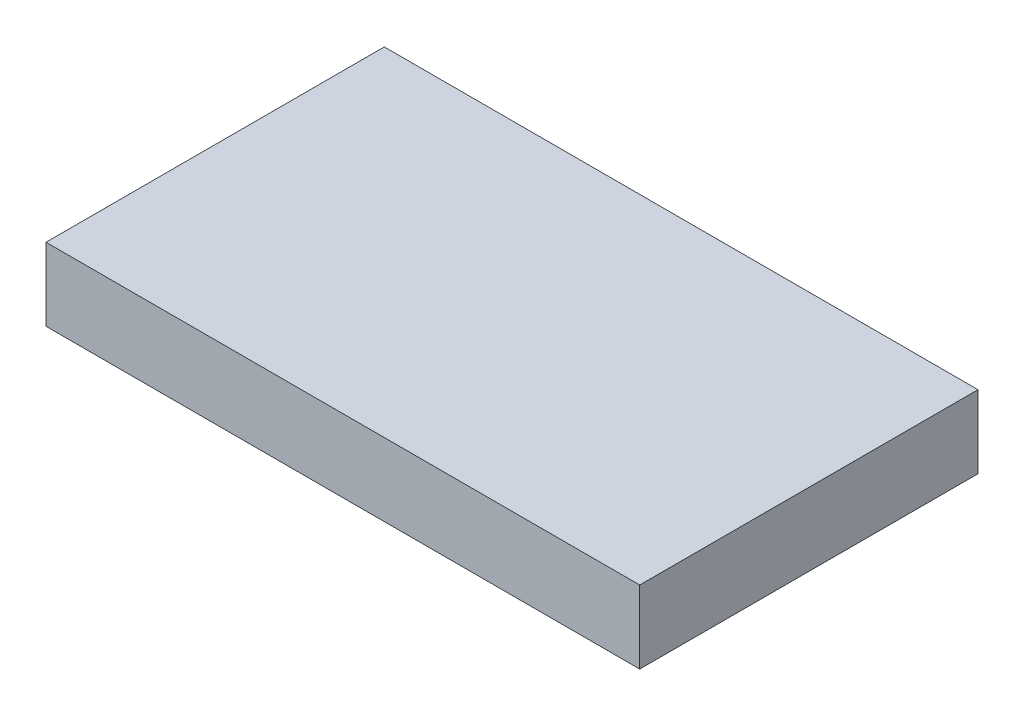
ISO-10303-21;
HEADER;
FILE_DESCRIPTION(('STEP AP214'),'2;1');
FILE_NAME('part.step','',(''),(''),'','','');
FILE_SCHEMA(('AUTOMOTIVE_DESIGN { 1 0 10303 214 1 1 1 1 }'));
ENDSEC;
DATA;
#1=APPLICATION_CONTEXT('core data for automotive mechanical design processes');
#2=APPLICATION_PROTOCOL_DEFINITION('international standard','automotive_design',2000,#1);
#3=PRODUCT_CONTEXT('',#1,'mechanical');
#4=PRODUCT('Part','Part','',(#3));
#5=PRODUCT_RELATED_PRODUCT_CATEGORY('part','',(#4));
#6=PRODUCT_DEFINITION_FORMATION('','',#4);
#7=PRODUCT_DEFINITION_CONTEXT('part definition',#1,'design');
#8=PRODUCT_DEFINITION('design','',#6,#7);
#9=PRODUCT_DEFINITION_SHAPE('','',#8);
#10=(LENGTH_UNIT() NAMED_UNIT(*) SI_UNIT(.MILLI.,.METRE.));
#11=(NAMED_UNIT(*) PLANE_ANGLE_UNIT() SI_UNIT($,.RADIAN.));
#12=(NAMED_UNIT(*) SI_UNIT($,.STERADIAN.) SOLID_ANGLE_UNIT());
#13=UNCERTAINTY_MEASURE_WITH_UNIT(LENGTH_MEASURE(1.E-05),#10,'distance_accuracy_value','');
#14=(GEOMETRIC_REPRESENTATION_CONTEXT(3) GLOBAL_UNCERTAINTY_ASSIGNED_CONTEXT((#13)) GLOBAL_UNIT_ASSIGNED_CONTEXT((#10,
#11,#12)) REPRESENTATION_CONTEXT('',''));
#15=CARTESIAN_POINT('',(0.,0.,0.));
#16=DIRECTION('',(0.,0.,1.));
#17=DIRECTION('',(1.,0.,0.));
#18=AXIS2_PLACEMENT_3D('',#15,#16,#17);
#19=CARTESIAN_POINT('',(26.5,6.5,15.1));
#20=DIRECTION('',(-1.,0.,0.));
#21=DIRECTION('',(0.,0.,1.));
#22=AXIS2_PLACEMENT_3D('',#19,#20,#21);
#23=PLANE('',#22);
#24=DIRECTION('',(0.,0.,-1.));
#25=VECTOR('',#24,1.);
#26=CARTESIAN_POINT('',(26.5,0.,15.1));
#27=LINE('',#26,#25);
#28=CARTESIAN_POINT('',(26.5,0.,15.1));
#29=VERTEX_POINT('',#28);
#30=CARTESIAN_POINT('',(26.5,0.,-15.1));
#31=VERTEX_POINT('',#30);
#32=EDGE_CURVE('E106',#29,#31,#27,.T.);
#33=ORIENTED_EDGE('',*,*,#32,.T.);
#34=DIRECTION('',(0.,-1.,0.));
#35=VECTOR('',#34,1.);
#36=CARTESIAN_POINT('',(26.5,6.5,-15.1));
#37=LINE('',#36,#35);
#38=CARTESIAN_POINT('',(26.5,6.5,-15.1));
#39=VERTEX_POINT('',#38);
#40=EDGE_CURVE('E11',#39,#31,#37,.T.);
#41=ORIENTED_EDGE('',*,*,#40,.F.);
#42=DIRECTION('',(0.,0.,-1.));
#43=VECTOR('',#42,1.);
#44=CARTESIAN_POINT('',(26.5,6.5,15.1));
#45=LINE('',#44,#43);
#46=CARTESIAN_POINT('',(26.5,6.5,15.1));
#47=VERTEX_POINT('',#46);
#48=EDGE_CURVE('E94',#47,#39,#45,.T.);
#49=ORIENTED_EDGE('',*,*,#48,.F.);
#50=DIRECTION('',(0.,-1.,0.));
#51=VECTOR('',#50,1.);
#52=CARTESIAN_POINT('',(26.5,6.5,15.1));
#53=LINE('',#52,#51);
#54=EDGE_CURVE('E102',#47,#29,#53,.T.);
#55=ORIENTED_EDGE('',*,*,#54,.T.);
#56=EDGE_LOOP('',(#33,#41,#49,#55));
#57=FACE_BOUND('',#56,.T.);
#58=ADVANCED_FACE('F43',(#57),#23,.F.);
#59=CARTESIAN_POINT('',(-26.5,6.5,-15.1));
#60=DIRECTION('',(0.,0.,1.));
#61=DIRECTION('',(1.,0.,0.));
#62=AXIS2_PLACEMENT_3D('',#59,#60,#61);
#63=PLANE('',#62);
#64=DIRECTION('',(-1.,0.,0.));
#65=VECTOR('',#64,1.);
#66=CARTESIAN_POINT('',(-26.5,0.,-15.1));
#67=LINE('',#66,#65);
#68=CARTESIAN_POINT('',(-26.5,0.,-15.1));
#69=VERTEX_POINT('',#68);
#70=EDGE_CURVE('E98',#31,#69,#67,.T.);
#71=ORIENTED_EDGE('',*,*,#70,.T.);
#72=DIRECTION('',(0.,-1.,0.));
#73=VECTOR('',#72,1.);
#74=CARTESIAN_POINT('',(-26.5,6.5,-15.1));
#75=LINE('',#74,#73);
#76=CARTESIAN_POINT('',(-26.5,6.5,-15.1));
#77=VERTEX_POINT('',#76);
#78=EDGE_CURVE('E51',#77,#69,#75,.T.);
#79=ORIENTED_EDGE('',*,*,#78,.F.);
#80=DIRECTION('',(-1.,0.,0.));
#81=VECTOR('',#80,1.);
#82=CARTESIAN_POINT('',(-26.5,6.5,-15.1));
#83=LINE('',#82,#81);
#84=EDGE_CURVE('E89',#39,#77,#83,.T.);
#85=ORIENTED_EDGE('',*,*,#84,.F.);
#86=ORIENTED_EDGE('',*,*,#40,.T.);
#87=EDGE_LOOP('',(#71,#79,#85,#86));
#88=FACE_BOUND('',#87,.T.);
#89=ADVANCED_FACE('F97',(#88),#63,.F.);
#90=CARTESIAN_POINT('',(-26.5,6.5,15.1));
#91=DIRECTION('',(1.,0.,0.));
#92=DIRECTION('',(0.,0.,-1.));
#93=AXIS2_PLACEMENT_3D('',#90,#91,#92);
#94=PLANE('',#93);
#95=DIRECTION('',(0.,0.,1.));
#96=VECTOR('',#95,1.);
#97=CARTESIAN_POINT('',(-26.5,0.,15.1));
#98=LINE('',#97,#96);
#99=CARTESIAN_POINT('',(-26.5,0.,15.1));
#100=VERTEX_POINT('',#99);
#101=EDGE_CURVE('E76',#69,#100,#98,.T.);
#102=ORIENTED_EDGE('',*,*,#101,.T.);
#103=DIRECTION('',(0.,-1.,0.));
#104=VECTOR('',#103,1.);
#105=CARTESIAN_POINT('',(-26.5,6.5,15.1));
#106=LINE('',#105,#104);
#107=CARTESIAN_POINT('',(-26.5,6.5,15.1));
#108=VERTEX_POINT('',#107);
#109=EDGE_CURVE('E99',#108,#100,#106,.T.);
#110=ORIENTED_EDGE('',*,*,#109,.F.);
#111=DIRECTION('',(0.,0.,1.));
#112=VECTOR('',#111,1.);
#113=CARTESIAN_POINT('',(-26.5,6.5,15.1));
#114=LINE('',#113,#112);
#115=EDGE_CURVE('E92',#77,#108,#114,.T.);
#116=ORIENTED_EDGE('',*,*,#115,.F.);
#117=ORIENTED_EDGE('',*,*,#78,.T.);
#118=EDGE_LOOP('',(#102,#110,#116,#117));
#119=FACE_BOUND('',#118,.T.);
#120=ADVANCED_FACE('F100',(#119),#94,.F.);
#121=CARTESIAN_POINT('',(-26.5,6.5,15.1));
#122=DIRECTION('',(0.,0.,-1.));
#123=DIRECTION('',(-1.,0.,0.));
#124=AXIS2_PLACEMENT_3D('',#121,#122,#123);
#125=PLANE('',#124);
#126=DIRECTION('',(1.,0.,0.));
#127=VECTOR('',#126,1.);
#128=CARTESIAN_POINT('',(-26.5,0.,15.1));
#129=LINE('',#128,#127);
#130=EDGE_CURVE('E82',#100,#29,#129,.T.);
#131=ORIENTED_EDGE('',*,*,#130,.T.);
#132=ORIENTED_EDGE('',*,*,#54,.F.);
#133=DIRECTION('',(1.,0.,0.));
#134=VECTOR('',#133,1.);
#135=CARTESIAN_POINT('',(-26.5,6.5,15.1));
#136=LINE('',#135,#134);
#137=EDGE_CURVE('E59',#108,#47,#136,.T.);
#138=ORIENTED_EDGE('',*,*,#137,.F.);
#139=ORIENTED_EDGE('',*,*,#109,.T.);
#140=EDGE_LOOP('',(#131,#132,#138,#139));
#141=FACE_BOUND('',#140,.T.);
#142=ADVANCED_FACE('F113',(#141),#125,.F.);
#143=CARTESIAN_POINT('',(0.,6.5,0.));
#144=DIRECTION('',(0.,-1.,0.));
#145=DIRECTION('',(0.,0.,-1.));
#146=AXIS2_PLACEMENT_3D('',#143,#144,#145);
#147=PLANE('',#146);
#148=ORIENTED_EDGE('',*,*,#48,.T.);
#149=ORIENTED_EDGE('',*,*,#84,.T.);
#150=ORIENTED_EDGE('',*,*,#115,.T.);
#151=ORIENTED_EDGE('',*,*,#137,.T.);
#152=EDGE_LOOP('',(#148,#149,#150,#151));
#153=FACE_BOUND('',#152,.T.);
#154=ADVANCED_FACE('F90',(#153),#147,.F.);
#155=CARTESIAN_POINT('',(0.,0.,0.));
#156=DIRECTION('',(0.,-1.,0.));
#157=DIRECTION('',(0.,0.,-1.));
#158=AXIS2_PLACEMENT_3D('',#155,#156,#157);
#159=PLANE('',#158);
#160=ORIENTED_EDGE('',*,*,#32,.F.);
#161=ORIENTED_EDGE('',*,*,#130,.F.);
#162=ORIENTED_EDGE('',*,*,#101,.F.);
#163=ORIENTED_EDGE('',*,*,#70,.F.);
#164=EDGE_LOOP('',(#160,#161,#162,#163));
#165=FACE_BOUND('',#164,.T.);
#166=ADVANCED_FACE('F116',(#165),#159,.T.);
#167=CLOSED_SHELL('',(#58,#89,#120,#142,#154,#166));
#168=MANIFOLD_SOLID_BREP('B2',#167);
#169=ADVANCED_BREP_SHAPE_REPRESENTATION('',(#18,#168),#14);
#170=SHAPE_DEFINITION_REPRESENTATION(#9,#169);
ENDSEC;
END-ISO-10303-21;
